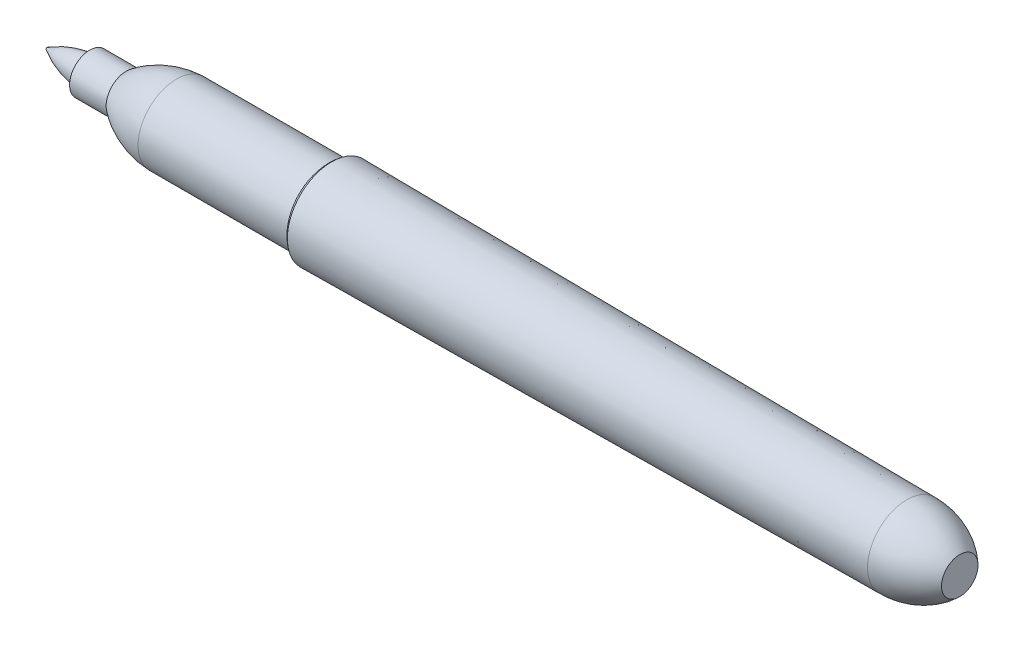
ISO-10303-21;
HEADER;
FILE_DESCRIPTION(('STEP AP214'),'2;1');
FILE_NAME('part.step','',(''),(''),'','','');
FILE_SCHEMA(('AUTOMOTIVE_DESIGN { 1 0 10303 214 1 1 1 1 }'));
ENDSEC;
DATA;
#1=APPLICATION_CONTEXT('core data for automotive mechanical design processes');
#2=APPLICATION_PROTOCOL_DEFINITION('international standard','automotive_design',2000,#1);
#3=PRODUCT_CONTEXT('',#1,'mechanical');
#4=PRODUCT('Part','Part','',(#3));
#5=PRODUCT_RELATED_PRODUCT_CATEGORY('part','',(#4));
#6=PRODUCT_DEFINITION_FORMATION('','',#4);
#7=PRODUCT_DEFINITION_CONTEXT('part definition',#1,'design');
#8=PRODUCT_DEFINITION('design','',#6,#7);
#9=PRODUCT_DEFINITION_SHAPE('','',#8);
#10=(LENGTH_UNIT() NAMED_UNIT(*) SI_UNIT(.MILLI.,.METRE.));
#11=(NAMED_UNIT(*) PLANE_ANGLE_UNIT() SI_UNIT($,.RADIAN.));
#12=(NAMED_UNIT(*) SI_UNIT($,.STERADIAN.) SOLID_ANGLE_UNIT());
#13=UNCERTAINTY_MEASURE_WITH_UNIT(LENGTH_MEASURE(1.E-05),#10,'distance_accuracy_value','');
#14=(GEOMETRIC_REPRESENTATION_CONTEXT(3) GLOBAL_UNCERTAINTY_ASSIGNED_CONTEXT((#13)) GLOBAL_UNIT_ASSIGNED_CONTEXT((#10,
#11,#12)) REPRESENTATION_CONTEXT('',''));
#15=CARTESIAN_POINT('',(0.,0.,0.));
#16=DIRECTION('',(0.,0.,1.));
#17=DIRECTION('',(1.,0.,0.));
#18=AXIS2_PLACEMENT_3D('',#15,#16,#17);
#19=CARTESIAN_POINT('',(0.,0.,0.));
#20=DIRECTION('',(1.,0.,0.));
#21=DIRECTION('',(0.,1.,0.));
#22=AXIS2_PLACEMENT_3D('',#19,#20,#21);
#23=PLANE('',#22);
#24=CARTESIAN_POINT('',(0.,0.,0.));
#25=DIRECTION('',(1.,0.,0.));
#26=DIRECTION('',(0.,1.,0.));
#27=AXIS2_PLACEMENT_3D('',#24,#25,#26);
#28=CIRCLE('',#27,2.54);
#29=CARTESIAN_POINT('',(0.,2.54,0.));
#30=VERTEX_POINT('',#29);
#31=EDGE_CURVE('E54',#30,#30,#28,.T.);
#32=ORIENTED_EDGE('',*,*,#31,.T.);
#33=EDGE_LOOP('',(#32));
#34=FACE_BOUND('',#33,.T.);
#35=ADVANCED_FACE('F43',(#34),#23,.T.);
#36=CARTESIAN_POINT('',(-7.2646615787926,0.,0.));
#37=DIRECTION('',(1.,0.,0.));
#38=DIRECTION('',(0.,1.,0.));
#39=AXIS2_PLACEMENT_3D('',#36,#37,#38);
#40=DEGENERATE_TOROIDAL_SURFACE('',#39,5.03151615521612,10.4930055152508,.F.);
#41=ORIENTED_EDGE('',*,*,#31,.F.);
#42=EDGE_LOOP('',(#41));
#43=FACE_BOUND('',#42,.T.);
#44=CARTESIAN_POINT('',(-7.366,0.,0.));
#45=DIRECTION('',(1.,0.,0.));
#46=DIRECTION('',(0.,1.,0.));
#47=AXIS2_PLACEMENT_3D('',#44,#45,#46);
#48=CIRCLE('',#47,5.461);
#49=CARTESIAN_POINT('',(-7.366,5.461,0.));
#50=VERTEX_POINT('',#49);
#51=EDGE_CURVE('E58',#50,#50,#48,.T.);
#52=ORIENTED_EDGE('',*,*,#51,.T.);
#53=EDGE_LOOP('',(#52));
#54=FACE_BOUND('',#53,.T.);
#55=ADVANCED_FACE('F97',(#43,#54),#40,.F.);
#56=CARTESIAN_POINT('',(-87.376,0.,0.));
#57=DIRECTION('',(-1.,0.,0.));
#58=DIRECTION('',(0.,-1.,0.));
#59=AXIS2_PLACEMENT_3D('',#56,#57,#58);
#60=CONICAL_SURFACE('',#59,6.1595,0.0087299369486641);
#61=ORIENTED_EDGE('',*,*,#51,.F.);
#62=EDGE_LOOP('',(#61));
#63=FACE_BOUND('',#62,.T.);
#64=CARTESIAN_POINT('',(-87.376,0.,0.));
#65=DIRECTION('',(1.,0.,0.));
#66=DIRECTION('',(0.,1.,0.));
#67=AXIS2_PLACEMENT_3D('',#64,#65,#66);
#68=CIRCLE('',#67,6.1595);
#69=CARTESIAN_POINT('',(-87.376,6.15949999999999,0.));
#70=VERTEX_POINT('',#69);
#71=EDGE_CURVE('E63',#70,#70,#68,.T.);
#72=ORIENTED_EDGE('',*,*,#71,.T.);
#73=EDGE_LOOP('',(#72));
#74=FACE_BOUND('',#73,.T.);
#75=ADVANCED_FACE('F102',(#63,#74),#60,.T.);
#76=CARTESIAN_POINT('',(-85.9452999089162,0.,0.));
#77=DIRECTION('',(1.,0.,0.));
#78=DIRECTION('',(0.,1.,0.));
#79=AXIS2_PLACEMENT_3D('',#76,#77,#78);
#80=TOROIDAL_SURFACE('',#79,4.07441145438414,2.5287342671158);
#81=ORIENTED_EDGE('',*,*,#71,.F.);
#82=EDGE_LOOP('',(#81));
#83=FACE_BOUND('',#82,.T.);
#84=CARTESIAN_POINT('',(-88.138,0.,0.));
#85=DIRECTION('',(1.,0.,0.));
#86=DIRECTION('',(0.,1.,0.));
#87=AXIS2_PLACEMENT_3D('',#84,#85,#86);
#88=CIRCLE('',#87,5.334);
#89=CARTESIAN_POINT('',(-88.138,5.33399999999999,0.));
#90=VERTEX_POINT('',#89);
#91=EDGE_CURVE('E66',#90,#90,#88,.T.);
#92=ORIENTED_EDGE('',*,*,#91,.T.);
#93=EDGE_LOOP('',(#92));
#94=FACE_BOUND('',#93,.T.);
#95=ADVANCED_FACE('F108',(#83,#94),#80,.T.);
#96=CARTESIAN_POINT('',(0.,0.,0.));
#97=DIRECTION('',(1.,0.,0.));
#98=DIRECTION('',(0.,1.,0.));
#99=AXIS2_PLACEMENT_3D('',#96,#97,#98);
#100=CYLINDRICAL_SURFACE('',#99,5.334);
#101=ORIENTED_EDGE('',*,*,#91,.F.);
#102=EDGE_LOOP('',(#101));
#103=FACE_BOUND('',#102,.T.);
#104=CARTESIAN_POINT('',(-108.966,0.,0.));
#105=DIRECTION('',(1.,0.,0.));
#106=DIRECTION('',(0.,1.,0.));
#107=AXIS2_PLACEMENT_3D('',#104,#105,#106);
#108=CIRCLE('',#107,5.334);
#109=CARTESIAN_POINT('',(-108.966,5.33399999999999,0.));
#110=VERTEX_POINT('',#109);
#111=EDGE_CURVE('E69',#110,#110,#108,.T.);
#112=ORIENTED_EDGE('',*,*,#111,.T.);
#113=EDGE_LOOP('',(#112));
#114=FACE_BOUND('',#113,.T.);
#115=ADVANCED_FACE('F112',(#103,#114),#100,.T.);
#116=CARTESIAN_POINT('',(-108.466335736646,0.,0.));
#117=DIRECTION('',(1.,0.,0.));
#118=DIRECTION('',(0.,1.,0.));
#119=AXIS2_PLACEMENT_3D('',#116,#117,#118);
#120=DEGENERATE_TOROIDAL_SURFACE('',#119,6.91445172422375,12.2586391584349,.F.);
#121=ORIENTED_EDGE('',*,*,#111,.F.);
#122=EDGE_LOOP('',(#121));
#123=FACE_BOUND('',#122,.T.);
#124=CARTESIAN_POINT('',(-115.951,0.,0.));
#125=DIRECTION('',(1.,0.,0.));
#126=DIRECTION('',(0.,1.,0.));
#127=AXIS2_PLACEMENT_3D('',#124,#125,#126);
#128=CIRCLE('',#127,2.794);
#129=CARTESIAN_POINT('',(-115.951,2.79399999999999,0.));
#130=VERTEX_POINT('',#129);
#131=EDGE_CURVE('E72',#130,#130,#128,.T.);
#132=ORIENTED_EDGE('',*,*,#131,.T.);
#133=EDGE_LOOP('',(#132));
#134=FACE_BOUND('',#133,.T.);
#135=ADVANCED_FACE('F116',(#123,#134),#120,.F.);
#136=CARTESIAN_POINT('',(0.,0.,0.));
#137=DIRECTION('',(1.,0.,0.));
#138=DIRECTION('',(0.,1.,0.));
#139=AXIS2_PLACEMENT_3D('',#136,#137,#138);
#140=CYLINDRICAL_SURFACE('',#139,2.794);
#141=ORIENTED_EDGE('',*,*,#131,.F.);
#142=EDGE_LOOP('',(#141));
#143=FACE_BOUND('',#142,.T.);
#144=CARTESIAN_POINT('',(-121.031,0.,0.));
#145=DIRECTION('',(1.,0.,0.));
#146=DIRECTION('',(0.,1.,0.));
#147=AXIS2_PLACEMENT_3D('',#144,#145,#146);
#148=CIRCLE('',#147,2.794);
#149=CARTESIAN_POINT('',(-121.031,2.79399999999999,0.));
#150=VERTEX_POINT('',#149);
#151=EDGE_CURVE('E75',#150,#150,#148,.T.);
#152=ORIENTED_EDGE('',*,*,#151,.T.);
#153=EDGE_LOOP('',(#152));
#154=FACE_BOUND('',#153,.T.);
#155=ADVANCED_FACE('F93',(#143,#154),#140,.T.);
#156=CARTESIAN_POINT('',(-121.031,0.,0.));
#157=DIRECTION('',(1.,0.,0.));
#158=DIRECTION('',(0.,1.,0.));
#159=AXIS2_PLACEMENT_3D('',#156,#157,#158);
#160=PLANE('',#159);
#161=ORIENTED_EDGE('',*,*,#151,.F.);
#162=EDGE_LOOP('',(#161));
#163=FACE_BOUND('',#162,.T.);
#164=CARTESIAN_POINT('',(-121.031,0.,0.));
#165=DIRECTION('',(1.,0.,0.));
#166=DIRECTION('',(0.,1.,0.));
#167=AXIS2_PLACEMENT_3D('',#164,#165,#166);
#168=CIRCLE('',#167,1.905);
#169=CARTESIAN_POINT('',(-121.031,1.90499999999999,0.));
#170=VERTEX_POINT('',#169);
#171=EDGE_CURVE('E78',#170,#170,#168,.T.);
#172=ORIENTED_EDGE('',*,*,#171,.T.);
#173=EDGE_LOOP('',(#172));
#174=FACE_BOUND('',#173,.T.);
#175=ADVANCED_FACE('F82',(#163,#174),#160,.F.);
#176=CARTESIAN_POINT('',(-120.469308465474,0.,0.));
#177=DIRECTION('',(1.,0.,0.));
#178=DIRECTION('',(0.,1.,0.));
#179=AXIS2_PLACEMENT_3D('',#176,#177,#178);
#180=DEGENERATE_TOROIDAL_SURFACE('',#179,10.8890715801937,12.8063954717586,.F.);
#181=CARTESIAN_POINT('',(-126.937140977911,0.,0.));
#182=DIRECTION('',(1.,0.,0.));
#183=DIRECTION('',(0.,1.,0.));
#184=AXIS2_PLACEMENT_3D('',#181,#182,#183);
#185=CIRCLE('',#184,0.164023351549968);
#186=CARTESIAN_POINT('',(-126.937140977911,0.164023351549951,0.));
#187=VERTEX_POINT('',#186);
#188=EDGE_CURVE('E50',#187,#187,#185,.T.);
#189=ORIENTED_EDGE('',*,*,#188,.T.);
#190=EDGE_LOOP('',(#189));
#191=FACE_BOUND('',#190,.T.);
#192=ORIENTED_EDGE('',*,*,#171,.F.);
#193=EDGE_LOOP('',(#192));
#194=FACE_BOUND('',#193,.T.);
#195=ADVANCED_FACE('F84',(#191,#194),#180,.F.);
#196=CARTESIAN_POINT('',(-127.,0.,0.));
#197=DIRECTION('',(-1.,0.,0.));
#198=DIRECTION('',(0.,-1.,0.));
#199=AXIS2_PLACEMENT_3D('',#196,#197,#198);
#200=PLANE('',#199);
#201=CARTESIAN_POINT('',(-127.,0.,0.));
#202=DIRECTION('',(-1.,0.,0.));
#203=DIRECTION('',(0.,-1.,0.));
#204=AXIS2_PLACEMENT_3D('',#201,#202,#203);
#205=CIRCLE('',#204,0.0544106928258899);
#206=CARTESIAN_POINT('',(-127.,-0.0544106928259063,0.));
#207=VERTEX_POINT('',#206);
#208=EDGE_CURVE('E12',#207,#207,#205,.T.);
#209=ORIENTED_EDGE('',*,*,#208,.T.);
#210=EDGE_LOOP('',(#209));
#211=FACE_BOUND('',#210,.T.);
#212=ADVANCED_FACE('F86',(#211),#200,.T.);
#213=CARTESIAN_POINT('',(-126.873,0.,0.));
#214=DIRECTION('',(-1.,0.,0.));
#215=DIRECTION('',(0.,-1.,0.));
#216=AXIS2_PLACEMENT_3D('',#213,#214,#215);
#217=DEGENERATE_TOROIDAL_SURFACE('',#216,0.0544106928258899,0.127,.T.);
#218=ORIENTED_EDGE('',*,*,#208,.F.);
#219=EDGE_LOOP('',(#218));
#220=FACE_BOUND('',#219,.T.);
#221=ORIENTED_EDGE('',*,*,#188,.F.);
#222=EDGE_LOOP('',(#221));
#223=FACE_BOUND('',#222,.T.);
#224=ADVANCED_FACE('F45',(#220,#223),#217,.T.);
#225=CLOSED_SHELL('',(#35,#55,#75,#95,#115,#135,#155,#175,#195,#212,#224));
#226=MANIFOLD_SOLID_BREP('B2',#225);
#227=ADVANCED_BREP_SHAPE_REPRESENTATION('',(#18,#226),#14);
#228=SHAPE_DEFINITION_REPRESENTATION(#9,#227);
ENDSEC;
END-ISO-10303-21;
